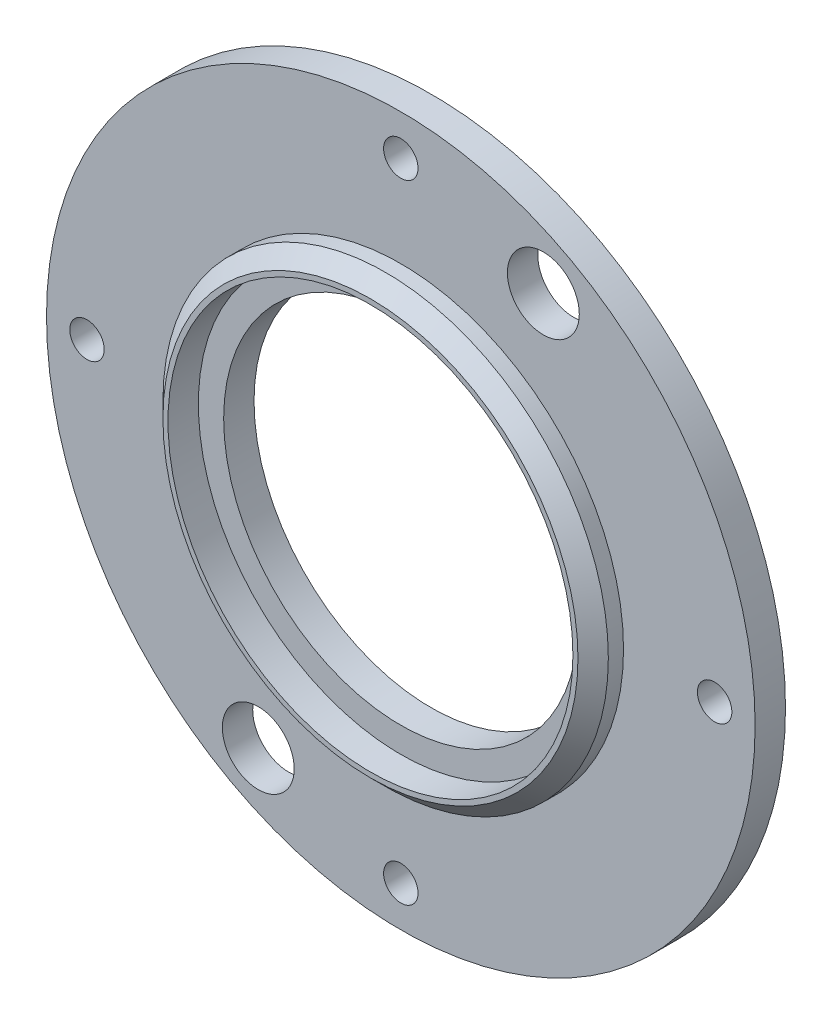
ISO-10303-21;
HEADER;
FILE_DESCRIPTION(('STEP AP214'),'2;1');
FILE_NAME('part.step','',(''),(''),'','','');
FILE_SCHEMA(('AUTOMOTIVE_DESIGN { 1 0 10303 214 1 1 1 1 }'));
ENDSEC;
DATA;
#1=APPLICATION_CONTEXT('core data for automotive mechanical design processes');
#2=APPLICATION_PROTOCOL_DEFINITION('international standard','automotive_design',2000,#1);
#3=PRODUCT_CONTEXT('',#1,'mechanical');
#4=PRODUCT('Part','Part','',(#3));
#5=PRODUCT_RELATED_PRODUCT_CATEGORY('part','',(#4));
#6=PRODUCT_DEFINITION_FORMATION('','',#4);
#7=PRODUCT_DEFINITION_CONTEXT('part definition',#1,'design');
#8=PRODUCT_DEFINITION('design','',#6,#7);
#9=PRODUCT_DEFINITION_SHAPE('','',#8);
#10=(LENGTH_UNIT() NAMED_UNIT(*) SI_UNIT(.MILLI.,.METRE.));
#11=(NAMED_UNIT(*) PLANE_ANGLE_UNIT() SI_UNIT($,.RADIAN.));
#12=(NAMED_UNIT(*) SI_UNIT($,.STERADIAN.) SOLID_ANGLE_UNIT());
#13=UNCERTAINTY_MEASURE_WITH_UNIT(LENGTH_MEASURE(1.E-05),#10,'distance_accuracy_value','');
#14=(GEOMETRIC_REPRESENTATION_CONTEXT(3) GLOBAL_UNCERTAINTY_ASSIGNED_CONTEXT((#13)) GLOBAL_UNIT_ASSIGNED_CONTEXT((#10,
#11,#12)) REPRESENTATION_CONTEXT('',''));
#15=CARTESIAN_POINT('',(0.,0.,0.));
#16=DIRECTION('',(0.,0.,1.));
#17=DIRECTION('',(1.,0.,0.));
#18=AXIS2_PLACEMENT_3D('',#15,#16,#17);
#19=CARTESIAN_POINT('',(0.,0.,0.));
#20=DIRECTION('',(0.,0.,1.));
#21=DIRECTION('',(1.,0.,0.));
#22=AXIS2_PLACEMENT_3D('',#19,#20,#21);
#23=PLANE('',#22);
#24=CARTESIAN_POINT('',(-31.,3.24707764512411E-13,0.));
#25=DIRECTION('',(0.,0.,-1.));
#26=DIRECTION('',(-1.,0.,0.));
#27=AXIS2_PLACEMENT_3D('',#24,#25,#26);
#28=CIRCLE('',#27,1.7);
#29=CARTESIAN_POINT('',(-32.7,3.24707764512411E-13,0.));
#30=VERTEX_POINT('',#29);
#31=EDGE_CURVE('E128',#30,#30,#28,.T.);
#32=ORIENTED_EDGE('',*,*,#31,.F.);
#33=EDGE_LOOP('',(#32));
#34=FACE_BOUND('',#33,.T.);
#35=CARTESIAN_POINT('',(0.,-31.,0.));
#36=DIRECTION('',(0.,0.,-1.));
#37=DIRECTION('',(-1.,0.,0.));
#38=AXIS2_PLACEMENT_3D('',#35,#36,#37);
#39=CIRCLE('',#38,1.7);
#40=CARTESIAN_POINT('',(-1.7,-31.,0.));
#41=VERTEX_POINT('',#40);
#42=EDGE_CURVE('E61',#41,#41,#39,.T.);
#43=ORIENTED_EDGE('',*,*,#42,.F.);
#44=EDGE_LOOP('',(#43));
#45=FACE_BOUND('',#44,.T.);
#46=CARTESIAN_POINT('',(0.,0.,0.));
#47=DIRECTION('',(0.,0.,1.));
#48=DIRECTION('',(1.,0.,0.));
#49=AXIS2_PLACEMENT_3D('',#46,#47,#48);
#50=CIRCLE('',#49,17.5);
#51=CARTESIAN_POINT('',(17.5,0.,0.));
#52=VERTEX_POINT('',#51);
#53=EDGE_CURVE('E73',#52,#52,#50,.T.);
#54=ORIENTED_EDGE('',*,*,#53,.T.);
#55=EDGE_LOOP('',(#54));
#56=FACE_BOUND('',#55,.T.);
#57=CARTESIAN_POINT('',(0.,0.,0.));
#58=DIRECTION('',(0.,0.,1.));
#59=DIRECTION('',(1.,0.,0.));
#60=AXIS2_PLACEMENT_3D('',#57,#58,#59);
#61=CIRCLE('',#60,35.);
#62=CARTESIAN_POINT('',(35.,0.,0.));
#63=VERTEX_POINT('',#62);
#64=EDGE_CURVE('E77',#63,#63,#61,.T.);
#65=ORIENTED_EDGE('',*,*,#64,.F.);
#66=EDGE_LOOP('',(#65));
#67=FACE_BOUND('',#66,.T.);
#68=CARTESIAN_POINT('',(0.,31.,0.));
#69=DIRECTION('',(0.,0.,-1.));
#70=DIRECTION('',(-1.,0.,0.));
#71=AXIS2_PLACEMENT_3D('',#68,#69,#70);
#72=CIRCLE('',#71,1.7);
#73=CARTESIAN_POINT('',(-1.7,31.,0.));
#74=VERTEX_POINT('',#73);
#75=EDGE_CURVE('E48',#74,#74,#72,.T.);
#76=ORIENTED_EDGE('',*,*,#75,.F.);
#77=EDGE_LOOP('',(#76));
#78=FACE_BOUND('',#77,.T.);
#79=CARTESIAN_POINT('',(31.,-1.08235921504137E-13,0.));
#80=DIRECTION('',(0.,0.,-1.));
#81=DIRECTION('',(-1.,0.,0.));
#82=AXIS2_PLACEMENT_3D('',#79,#80,#81);
#83=CIRCLE('',#82,1.7);
#84=CARTESIAN_POINT('',(29.3,-1.08235921504137E-13,0.));
#85=VERTEX_POINT('',#84);
#86=EDGE_CURVE('E49',#85,#85,#83,.T.);
#87=ORIENTED_EDGE('',*,*,#86,.F.);
#88=EDGE_LOOP('',(#87));
#89=FACE_BOUND('',#88,.T.);
#90=CARTESIAN_POINT('',(14.08,26.49,0.));
#91=DIRECTION('',(0.,0.,-1.));
#92=DIRECTION('',(-1.,0.,0.));
#93=AXIS2_PLACEMENT_3D('',#90,#91,#92);
#94=CIRCLE('',#93,3.55);
#95=CARTESIAN_POINT('',(10.53,26.49,0.));
#96=VERTEX_POINT('',#95);
#97=EDGE_CURVE('E116',#96,#96,#94,.T.);
#98=ORIENTED_EDGE('',*,*,#97,.F.);
#99=EDGE_LOOP('',(#98));
#100=FACE_BOUND('',#99,.T.);
#101=CARTESIAN_POINT('',(-14.08,-26.49,0.));
#102=DIRECTION('',(0.,0.,-1.));
#103=DIRECTION('',(-1.,0.,0.));
#104=AXIS2_PLACEMENT_3D('',#101,#102,#103);
#105=CIRCLE('',#104,3.55);
#106=CARTESIAN_POINT('',(-17.63,-26.49,0.));
#107=VERTEX_POINT('',#106);
#108=EDGE_CURVE('E119',#107,#107,#105,.T.);
#109=ORIENTED_EDGE('',*,*,#108,.F.);
#110=EDGE_LOOP('',(#109));
#111=FACE_BOUND('',#110,.T.);
#112=ADVANCED_FACE('F30',(#34,#45,#56,#67,#78,#89,#100,#111),#23,.F.);
#113=CARTESIAN_POINT('',(0.,0.,3.));
#114=DIRECTION('',(0.,0.,1.));
#115=DIRECTION('',(1.,0.,0.));
#116=AXIS2_PLACEMENT_3D('',#113,#114,#115);
#117=PLANE('',#116);
#118=CARTESIAN_POINT('',(-14.08,-26.49,3.));
#119=DIRECTION('',(0.,0.,1.));
#120=DIRECTION('',(1.,0.,0.));
#121=AXIS2_PLACEMENT_3D('',#118,#119,#120);
#122=CIRCLE('',#121,3.55);
#123=CARTESIAN_POINT('',(-10.53,-26.49,3.));
#124=VERTEX_POINT('',#123);
#125=EDGE_CURVE('E34',#124,#124,#122,.T.);
#126=ORIENTED_EDGE('',*,*,#125,.F.);
#127=EDGE_LOOP('',(#126));
#128=FACE_BOUND('',#127,.T.);
#129=CARTESIAN_POINT('',(14.08,26.49,3.));
#130=DIRECTION('',(0.,0.,1.));
#131=DIRECTION('',(1.,0.,0.));
#132=AXIS2_PLACEMENT_3D('',#129,#130,#131);
#133=CIRCLE('',#132,3.55);
#134=CARTESIAN_POINT('',(17.63,26.49,3.));
#135=VERTEX_POINT('',#134);
#136=EDGE_CURVE('E125',#135,#135,#133,.T.);
#137=ORIENTED_EDGE('',*,*,#136,.F.);
#138=EDGE_LOOP('',(#137));
#139=FACE_BOUND('',#138,.T.);
#140=CARTESIAN_POINT('',(-31.,3.24707764512411E-13,3.));
#141=DIRECTION('',(0.,0.,1.));
#142=DIRECTION('',(1.,0.,0.));
#143=AXIS2_PLACEMENT_3D('',#140,#141,#142);
#144=CIRCLE('',#143,1.7);
#145=CARTESIAN_POINT('',(-29.3,3.24707764512411E-13,3.));
#146=VERTEX_POINT('',#145);
#147=EDGE_CURVE('E131',#146,#146,#144,.T.);
#148=ORIENTED_EDGE('',*,*,#147,.F.);
#149=EDGE_LOOP('',(#148));
#150=FACE_BOUND('',#149,.T.);
#151=CARTESIAN_POINT('',(0.,-31.,3.));
#152=DIRECTION('',(0.,0.,1.));
#153=DIRECTION('',(1.,0.,0.));
#154=AXIS2_PLACEMENT_3D('',#151,#152,#153);
#155=CIRCLE('',#154,1.7);
#156=CARTESIAN_POINT('',(1.7,-31.,3.));
#157=VERTEX_POINT('',#156);
#158=EDGE_CURVE('E56',#157,#157,#155,.T.);
#159=ORIENTED_EDGE('',*,*,#158,.F.);
#160=EDGE_LOOP('',(#159));
#161=FACE_BOUND('',#160,.T.);
#162=CARTESIAN_POINT('',(31.,-1.08235921504137E-13,3.));
#163=DIRECTION('',(0.,0.,1.));
#164=DIRECTION('',(1.,0.,0.));
#165=AXIS2_PLACEMENT_3D('',#162,#163,#164);
#166=CIRCLE('',#165,1.7);
#167=CARTESIAN_POINT('',(32.7,-1.08235921504137E-13,3.));
#168=VERTEX_POINT('',#167);
#169=EDGE_CURVE('E46',#168,#168,#166,.T.);
#170=ORIENTED_EDGE('',*,*,#169,.F.);
#171=EDGE_LOOP('',(#170));
#172=FACE_BOUND('',#171,.T.);
#173=CARTESIAN_POINT('',(0.,31.,3.));
#174=DIRECTION('',(0.,0.,1.));
#175=DIRECTION('',(1.,0.,0.));
#176=AXIS2_PLACEMENT_3D('',#173,#174,#175);
#177=CIRCLE('',#176,1.7);
#178=CARTESIAN_POINT('',(1.7,31.,3.));
#179=VERTEX_POINT('',#178);
#180=EDGE_CURVE('E53',#179,#179,#177,.T.);
#181=ORIENTED_EDGE('',*,*,#180,.F.);
#182=EDGE_LOOP('',(#181));
#183=FACE_BOUND('',#182,.T.);
#184=CARTESIAN_POINT('',(0.,0.,3.));
#185=DIRECTION('',(0.,0.,1.));
#186=DIRECTION('',(1.,0.,0.));
#187=AXIS2_PLACEMENT_3D('',#184,#185,#186);
#188=CIRCLE('',#187,35.);
#189=CARTESIAN_POINT('',(35.,0.,3.));
#190=VERTEX_POINT('',#189);
#191=EDGE_CURVE('E80',#190,#190,#188,.T.);
#192=ORIENTED_EDGE('',*,*,#191,.T.);
#193=EDGE_LOOP('',(#192));
#194=FACE_BOUND('',#193,.T.);
#195=CARTESIAN_POINT('',(0.,0.,3.));
#196=DIRECTION('',(0.,0.,1.));
#197=DIRECTION('',(1.,0.,0.));
#198=AXIS2_PLACEMENT_3D('',#195,#196,#197);
#199=CIRCLE('',#198,22.);
#200=CARTESIAN_POINT('',(22.,0.,3.));
#201=VERTEX_POINT('',#200);
#202=EDGE_CURVE('E70',#201,#201,#199,.T.);
#203=ORIENTED_EDGE('',*,*,#202,.F.);
#204=EDGE_LOOP('',(#203));
#205=FACE_BOUND('',#204,.T.);
#206=ADVANCED_FACE('F93',(#128,#139,#150,#161,#172,#183,#194,#205),#117,.T.);
#207=CARTESIAN_POINT('',(0.,0.,3.));
#208=DIRECTION('',(0.,0.,1.));
#209=DIRECTION('',(1.,0.,0.));
#210=AXIS2_PLACEMENT_3D('',#207,#208,#209);
#211=CIRCLE('',#210,20.);
#212=CARTESIAN_POINT('',(20.,0.,3.));
#213=VERTEX_POINT('',#212);
#214=EDGE_CURVE('E43',#213,#213,#211,.F.);
#215=ORIENTED_EDGE('',*,*,#214,.F.);
#216=EDGE_LOOP('',(#215));
#217=FACE_BOUND('',#216,.T.);
#218=CARTESIAN_POINT('',(0.,0.,3.));
#219=DIRECTION('',(0.,0.,1.));
#220=DIRECTION('',(1.,0.,0.));
#221=AXIS2_PLACEMENT_3D('',#218,#219,#220);
#222=CIRCLE('',#221,17.5);
#223=CARTESIAN_POINT('',(17.5,0.,3.));
#224=VERTEX_POINT('',#223);
#225=EDGE_CURVE('E74',#224,#224,#222,.T.);
#226=ORIENTED_EDGE('',*,*,#225,.F.);
#227=EDGE_LOOP('',(#226));
#228=FACE_BOUND('',#227,.T.);
#229=ADVANCED_FACE('F89',(#217,#228),#117,.T.);
#230=CARTESIAN_POINT('',(0.,0.,3.));
#231=DIRECTION('',(0.,0.,-1.));
#232=DIRECTION('',(-1.,0.,0.));
#233=AXIS2_PLACEMENT_3D('',#230,#231,#232);
#234=CYLINDRICAL_SURFACE('',#233,35.);
#235=ORIENTED_EDGE('',*,*,#191,.F.);
#236=EDGE_LOOP('',(#235));
#237=FACE_BOUND('',#236,.T.);
#238=ORIENTED_EDGE('',*,*,#64,.T.);
#239=EDGE_LOOP('',(#238));
#240=FACE_BOUND('',#239,.T.);
#241=ADVANCED_FACE('F92',(#237,#240),#234,.T.);
#242=CARTESIAN_POINT('',(0.,0.,3.));
#243=DIRECTION('',(0.,0.,-1.));
#244=DIRECTION('',(-1.,0.,0.));
#245=AXIS2_PLACEMENT_3D('',#242,#243,#244);
#246=CYLINDRICAL_SURFACE('',#245,17.5);
#247=ORIENTED_EDGE('',*,*,#225,.T.);
#248=EDGE_LOOP('',(#247));
#249=FACE_BOUND('',#248,.T.);
#250=ORIENTED_EDGE('',*,*,#53,.F.);
#251=EDGE_LOOP('',(#250));
#252=FACE_BOUND('',#251,.T.);
#253=ADVANCED_FACE('F97',(#249,#252),#246,.F.);
#254=CARTESIAN_POINT('',(0.,0.,6.));
#255=DIRECTION('',(0.,0.,1.));
#256=DIRECTION('',(1.,0.,0.));
#257=AXIS2_PLACEMENT_3D('',#254,#255,#256);
#258=PLANE('',#257);
#259=CARTESIAN_POINT('',(0.,0.,6.));
#260=DIRECTION('',(0.,0.,1.));
#261=DIRECTION('',(1.,0.,0.));
#262=AXIS2_PLACEMENT_3D('',#259,#260,#261);
#263=CIRCLE('',#262,20.5);
#264=CARTESIAN_POINT('',(20.5,0.,6.));
#265=VERTEX_POINT('',#264);
#266=EDGE_CURVE('E38',#265,#265,#263,.T.);
#267=ORIENTED_EDGE('',*,*,#266,.T.);
#268=EDGE_LOOP('',(#267));
#269=FACE_BOUND('',#268,.T.);
#270=CARTESIAN_POINT('',(0.,0.,6.));
#271=DIRECTION('',(0.,0.,1.));
#272=DIRECTION('',(1.,0.,0.));
#273=AXIS2_PLACEMENT_3D('',#270,#271,#272);
#274=CIRCLE('',#273,20.);
#275=CARTESIAN_POINT('',(20.,0.,6.));
#276=VERTEX_POINT('',#275);
#277=EDGE_CURVE('E67',#276,#276,#274,.T.);
#278=ORIENTED_EDGE('',*,*,#277,.F.);
#279=EDGE_LOOP('',(#278));
#280=FACE_BOUND('',#279,.T.);
#281=ADVANCED_FACE('F100',(#269,#280),#258,.T.);
#282=CARTESIAN_POINT('',(0.,0.,6.));
#283=DIRECTION('',(0.,0.,-1.));
#284=DIRECTION('',(-1.,0.,0.));
#285=AXIS2_PLACEMENT_3D('',#282,#283,#284);
#286=CYLINDRICAL_SURFACE('',#285,22.);
#287=CARTESIAN_POINT('',(0.,0.,4.50000000000002));
#288=DIRECTION('',(0.,0.,1.));
#289=DIRECTION('',(1.,0.,0.));
#290=AXIS2_PLACEMENT_3D('',#287,#288,#289);
#291=CIRCLE('',#290,22.);
#292=CARTESIAN_POINT('',(22.,0.,4.50000000000002));
#293=VERTEX_POINT('',#292);
#294=EDGE_CURVE('E10',#293,#293,#291,.F.);
#295=ORIENTED_EDGE('',*,*,#294,.T.);
#296=EDGE_LOOP('',(#295));
#297=FACE_BOUND('',#296,.T.);
#298=ORIENTED_EDGE('',*,*,#202,.T.);
#299=EDGE_LOOP('',(#298));
#300=FACE_BOUND('',#299,.T.);
#301=ADVANCED_FACE('F159',(#297,#300),#286,.T.);
#302=CARTESIAN_POINT('',(0.,0.,6.));
#303=DIRECTION('',(0.,0.,-1.));
#304=DIRECTION('',(-1.,0.,0.));
#305=AXIS2_PLACEMENT_3D('',#302,#303,#304);
#306=CYLINDRICAL_SURFACE('',#305,20.);
#307=ORIENTED_EDGE('',*,*,#277,.T.);
#308=EDGE_LOOP('',(#307));
#309=FACE_BOUND('',#308,.T.);
#310=ORIENTED_EDGE('',*,*,#214,.T.);
#311=EDGE_LOOP('',(#310));
#312=FACE_BOUND('',#311,.T.);
#313=ADVANCED_FACE('F87',(#309,#312),#306,.F.);
#314=CARTESIAN_POINT('',(0.,0.,6.));
#315=DIRECTION('',(0.,0.,-1.));
#316=DIRECTION('',(-1.,0.,0.));
#317=AXIS2_PLACEMENT_3D('',#314,#315,#316);
#318=CONICAL_SURFACE('',#317,20.5,0.785398163397448);
#319=ORIENTED_EDGE('',*,*,#294,.F.);
#320=EDGE_LOOP('',(#319));
#321=FACE_BOUND('',#320,.T.);
#322=ORIENTED_EDGE('',*,*,#266,.F.);
#323=EDGE_LOOP('',(#322));
#324=FACE_BOUND('',#323,.T.);
#325=ADVANCED_FACE('F32',(#321,#324),#318,.T.);
#326=CARTESIAN_POINT('',(0.,31.,0.));
#327=DIRECTION('',(0.,0.,-1.));
#328=DIRECTION('',(-1.,0.,0.));
#329=AXIS2_PLACEMENT_3D('',#326,#327,#328);
#330=CYLINDRICAL_SURFACE('',#329,1.7);
#331=ORIENTED_EDGE('',*,*,#180,.T.);
#332=EDGE_LOOP('',(#331));
#333=FACE_BOUND('',#332,.T.);
#334=ORIENTED_EDGE('',*,*,#75,.T.);
#335=EDGE_LOOP('',(#334));
#336=FACE_BOUND('',#335,.T.);
#337=ADVANCED_FACE('F150',(#333,#336),#330,.F.);
#338=CARTESIAN_POINT('',(31.,-1.08235921504137E-13,0.));
#339=DIRECTION('',(0.,0.,-1.));
#340=DIRECTION('',(-1.,0.,0.));
#341=AXIS2_PLACEMENT_3D('',#338,#339,#340);
#342=CYLINDRICAL_SURFACE('',#341,1.7);
#343=ORIENTED_EDGE('',*,*,#169,.T.);
#344=EDGE_LOOP('',(#343));
#345=FACE_BOUND('',#344,.T.);
#346=ORIENTED_EDGE('',*,*,#86,.T.);
#347=EDGE_LOOP('',(#346));
#348=FACE_BOUND('',#347,.T.);
#349=ADVANCED_FACE('F140',(#345,#348),#342,.F.);
#350=CARTESIAN_POINT('',(0.,-31.,0.));
#351=DIRECTION('',(0.,0.,-1.));
#352=DIRECTION('',(-1.,0.,0.));
#353=AXIS2_PLACEMENT_3D('',#350,#351,#352);
#354=CYLINDRICAL_SURFACE('',#353,1.7);
#355=ORIENTED_EDGE('',*,*,#158,.T.);
#356=EDGE_LOOP('',(#355));
#357=FACE_BOUND('',#356,.T.);
#358=ORIENTED_EDGE('',*,*,#42,.T.);
#359=EDGE_LOOP('',(#358));
#360=FACE_BOUND('',#359,.T.);
#361=ADVANCED_FACE('F136',(#357,#360),#354,.F.);
#362=CARTESIAN_POINT('',(-31.,3.24707764512411E-13,0.));
#363=DIRECTION('',(0.,0.,-1.));
#364=DIRECTION('',(-1.,0.,0.));
#365=AXIS2_PLACEMENT_3D('',#362,#363,#364);
#366=CYLINDRICAL_SURFACE('',#365,1.7);
#367=ORIENTED_EDGE('',*,*,#147,.T.);
#368=EDGE_LOOP('',(#367));
#369=FACE_BOUND('',#368,.T.);
#370=ORIENTED_EDGE('',*,*,#31,.T.);
#371=EDGE_LOOP('',(#370));
#372=FACE_BOUND('',#371,.T.);
#373=ADVANCED_FACE('F139',(#369,#372),#366,.F.);
#374=CARTESIAN_POINT('',(14.08,26.49,0.));
#375=DIRECTION('',(0.,0.,-1.));
#376=DIRECTION('',(-1.,0.,0.));
#377=AXIS2_PLACEMENT_3D('',#374,#375,#376);
#378=CYLINDRICAL_SURFACE('',#377,3.55);
#379=ORIENTED_EDGE('',*,*,#136,.T.);
#380=EDGE_LOOP('',(#379));
#381=FACE_BOUND('',#380,.T.);
#382=ORIENTED_EDGE('',*,*,#97,.T.);
#383=EDGE_LOOP('',(#382));
#384=FACE_BOUND('',#383,.T.);
#385=ADVANCED_FACE('F147',(#381,#384),#378,.F.);
#386=CARTESIAN_POINT('',(-14.08,-26.49,0.));
#387=DIRECTION('',(0.,0.,-1.));
#388=DIRECTION('',(-1.,0.,0.));
#389=AXIS2_PLACEMENT_3D('',#386,#387,#388);
#390=CYLINDRICAL_SURFACE('',#389,3.55);
#391=ORIENTED_EDGE('',*,*,#125,.T.);
#392=EDGE_LOOP('',(#391));
#393=FACE_BOUND('',#392,.T.);
#394=ORIENTED_EDGE('',*,*,#108,.T.);
#395=EDGE_LOOP('',(#394));
#396=FACE_BOUND('',#395,.T.);
#397=ADVANCED_FACE('F195',(#393,#396),#390,.F.);
#398=CLOSED_SHELL('',(#112,#206,#229,#241,#253,#281,#301,#313,#325,#337,#349,#361,#373,#385,#397));
#399=MANIFOLD_SOLID_BREP('B2',#398);
#400=ADVANCED_BREP_SHAPE_REPRESENTATION('',(#18,#399),#14);
#401=SHAPE_DEFINITION_REPRESENTATION(#9,#400);
ENDSEC;
END-ISO-10303-21;
